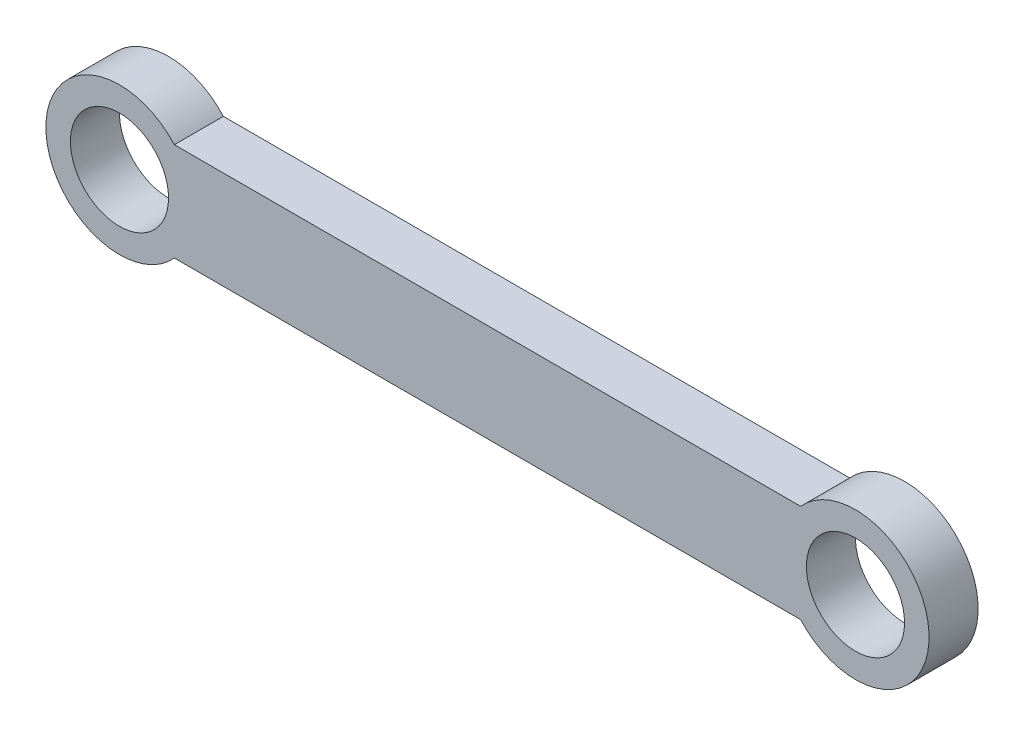
ISO-10303-21;
HEADER;
FILE_DESCRIPTION(('STEP AP214'),'2;1');
FILE_NAME('part.step','',(''),(''),'','','');
FILE_SCHEMA(('AUTOMOTIVE_DESIGN { 1 0 10303 214 1 1 1 1 }'));
ENDSEC;
DATA;
#1=APPLICATION_CONTEXT('core data for automotive mechanical design processes');
#2=APPLICATION_PROTOCOL_DEFINITION('international standard','automotive_design',2000,#1);
#3=PRODUCT_CONTEXT('',#1,'mechanical');
#4=PRODUCT('Part','Part','',(#3));
#5=PRODUCT_RELATED_PRODUCT_CATEGORY('part','',(#4));
#6=PRODUCT_DEFINITION_FORMATION('','',#4);
#7=PRODUCT_DEFINITION_CONTEXT('part definition',#1,'design');
#8=PRODUCT_DEFINITION('design','',#6,#7);
#9=PRODUCT_DEFINITION_SHAPE('','',#8);
#10=(LENGTH_UNIT() NAMED_UNIT(*) SI_UNIT(.MILLI.,.METRE.));
#11=(NAMED_UNIT(*) PLANE_ANGLE_UNIT() SI_UNIT($,.RADIAN.));
#12=(NAMED_UNIT(*) SI_UNIT($,.STERADIAN.) SOLID_ANGLE_UNIT());
#13=UNCERTAINTY_MEASURE_WITH_UNIT(LENGTH_MEASURE(1.E-05),#10,'distance_accuracy_value','');
#14=(GEOMETRIC_REPRESENTATION_CONTEXT(3) GLOBAL_UNCERTAINTY_ASSIGNED_CONTEXT((#13)) GLOBAL_UNIT_ASSIGNED_CONTEXT((#10,
#11,#12)) REPRESENTATION_CONTEXT('',''));
#15=CARTESIAN_POINT('',(0.,0.,0.));
#16=DIRECTION('',(0.,0.,1.));
#17=DIRECTION('',(1.,0.,0.));
#18=AXIS2_PLACEMENT_3D('',#15,#16,#17);
#19=CARTESIAN_POINT('',(15.,0.,2.));
#20=DIRECTION('',(0.,0.,1.));
#21=DIRECTION('',(1.,0.,0.));
#22=AXIS2_PLACEMENT_3D('',#19,#20,#21);
#23=PLANE('',#22);
#24=CARTESIAN_POINT('',(-15.,0.,2.));
#25=DIRECTION('',(0.,0.,1.));
#26=DIRECTION('',(1.,0.,0.));
#27=AXIS2_PLACEMENT_3D('',#24,#25,#26);
#28=CIRCLE('',#27,2.);
#29=CARTESIAN_POINT('',(-13.,0.,2.));
#30=VERTEX_POINT('',#29);
#31=EDGE_CURVE('E103',#30,#30,#28,.T.);
#32=ORIENTED_EDGE('',*,*,#31,.F.);
#33=EDGE_LOOP('',(#32));
#34=FACE_BOUND('',#33,.T.);
#35=CARTESIAN_POINT('',(15.,0.,2.));
#36=DIRECTION('',(0.,0.,1.));
#37=DIRECTION('',(1.,0.,0.));
#38=AXIS2_PLACEMENT_3D('',#35,#36,#37);
#39=CIRCLE('',#38,3.);
#40=CARTESIAN_POINT('',(12.7639320225002,-2.,2.));
#41=VERTEX_POINT('',#40);
#42=CARTESIAN_POINT('',(12.7639320225002,2.,2.));
#43=VERTEX_POINT('',#42);
#44=EDGE_CURVE('E88',#41,#43,#39,.T.);
#45=ORIENTED_EDGE('',*,*,#44,.T.);
#46=DIRECTION('',(-1.,0.,0.));
#47=VECTOR('',#46,1.);
#48=CARTESIAN_POINT('',(-12.7639320225002,2.,2.));
#49=LINE('',#48,#47);
#50=CARTESIAN_POINT('',(-12.7639320225002,2.,2.));
#51=VERTEX_POINT('',#50);
#52=EDGE_CURVE('E83',#43,#51,#49,.T.);
#53=ORIENTED_EDGE('',*,*,#52,.T.);
#54=CARTESIAN_POINT('',(-15.,0.,2.));
#55=DIRECTION('',(0.,0.,1.));
#56=DIRECTION('',(1.,0.,0.));
#57=AXIS2_PLACEMENT_3D('',#54,#55,#56);
#58=CIRCLE('',#57,3.);
#59=CARTESIAN_POINT('',(-12.7639320225002,-2.,2.));
#60=VERTEX_POINT('',#59);
#61=EDGE_CURVE('E86',#51,#60,#58,.T.);
#62=ORIENTED_EDGE('',*,*,#61,.T.);
#63=DIRECTION('',(1.,0.,0.));
#64=VECTOR('',#63,1.);
#65=CARTESIAN_POINT('',(-12.7639320225002,-2.,2.));
#66=LINE('',#65,#64);
#67=EDGE_CURVE('E53',#60,#41,#66,.T.);
#68=ORIENTED_EDGE('',*,*,#67,.T.);
#69=EDGE_LOOP('',(#45,#53,#62,#68));
#70=FACE_BOUND('',#69,.T.);
#71=CARTESIAN_POINT('',(15.,0.,2.));
#72=DIRECTION('',(0.,0.,1.));
#73=DIRECTION('',(1.,0.,0.));
#74=AXIS2_PLACEMENT_3D('',#71,#72,#73);
#75=CIRCLE('',#74,2.);
#76=CARTESIAN_POINT('',(17.,0.,2.));
#77=VERTEX_POINT('',#76);
#78=EDGE_CURVE('E118',#77,#77,#75,.T.);
#79=ORIENTED_EDGE('',*,*,#78,.F.);
#80=EDGE_LOOP('',(#79));
#81=FACE_BOUND('',#80,.T.);
#82=ADVANCED_FACE('F36',(#34,#70,#81),#23,.T.);
#83=CARTESIAN_POINT('',(15.,0.,0.));
#84=DIRECTION('',(0.,0.,1.));
#85=DIRECTION('',(1.,0.,0.));
#86=AXIS2_PLACEMENT_3D('',#83,#84,#85);
#87=PLANE('',#86);
#88=CARTESIAN_POINT('',(15.,0.,0.));
#89=DIRECTION('',(0.,0.,1.));
#90=DIRECTION('',(1.,0.,0.));
#91=AXIS2_PLACEMENT_3D('',#88,#89,#90);
#92=CIRCLE('',#91,3.);
#93=CARTESIAN_POINT('',(12.7639320225002,-2.,0.));
#94=VERTEX_POINT('',#93);
#95=CARTESIAN_POINT('',(12.7639320225002,2.,0.));
#96=VERTEX_POINT('',#95);
#97=EDGE_CURVE('E100',#94,#96,#92,.T.);
#98=ORIENTED_EDGE('',*,*,#97,.F.);
#99=DIRECTION('',(1.,0.,0.));
#100=VECTOR('',#99,1.);
#101=CARTESIAN_POINT('',(-12.7639320225002,-2.,0.));
#102=LINE('',#101,#100);
#103=CARTESIAN_POINT('',(-12.7639320225002,-2.,0.));
#104=VERTEX_POINT('',#103);
#105=EDGE_CURVE('E76',#104,#94,#102,.T.);
#106=ORIENTED_EDGE('',*,*,#105,.F.);
#107=CARTESIAN_POINT('',(-15.,0.,0.));
#108=DIRECTION('',(0.,0.,1.));
#109=DIRECTION('',(1.,0.,0.));
#110=AXIS2_PLACEMENT_3D('',#107,#108,#109);
#111=CIRCLE('',#110,3.);
#112=CARTESIAN_POINT('',(-12.7639320225002,2.,0.));
#113=VERTEX_POINT('',#112);
#114=EDGE_CURVE('E70',#113,#104,#111,.T.);
#115=ORIENTED_EDGE('',*,*,#114,.F.);
#116=DIRECTION('',(-1.,0.,0.));
#117=VECTOR('',#116,1.);
#118=CARTESIAN_POINT('',(-12.7639320225002,2.,0.));
#119=LINE('',#118,#117);
#120=EDGE_CURVE('E92',#96,#113,#119,.T.);
#121=ORIENTED_EDGE('',*,*,#120,.F.);
#122=EDGE_LOOP('',(#98,#106,#115,#121));
#123=FACE_BOUND('',#122,.T.);
#124=CARTESIAN_POINT('',(-15.,0.,0.));
#125=DIRECTION('',(0.,0.,1.));
#126=DIRECTION('',(1.,0.,0.));
#127=AXIS2_PLACEMENT_3D('',#124,#125,#126);
#128=CIRCLE('',#127,2.);
#129=CARTESIAN_POINT('',(-13.,0.,0.));
#130=VERTEX_POINT('',#129);
#131=EDGE_CURVE('E115',#130,#130,#128,.T.);
#132=ORIENTED_EDGE('',*,*,#131,.T.);
#133=EDGE_LOOP('',(#132));
#134=FACE_BOUND('',#133,.T.);
#135=CARTESIAN_POINT('',(15.,0.,0.));
#136=DIRECTION('',(0.,0.,1.));
#137=DIRECTION('',(1.,0.,0.));
#138=AXIS2_PLACEMENT_3D('',#135,#136,#137);
#139=CIRCLE('',#138,2.);
#140=CARTESIAN_POINT('',(17.,0.,0.));
#141=VERTEX_POINT('',#140);
#142=EDGE_CURVE('E121',#141,#141,#139,.T.);
#143=ORIENTED_EDGE('',*,*,#142,.T.);
#144=EDGE_LOOP('',(#143));
#145=FACE_BOUND('',#144,.T.);
#146=ADVANCED_FACE('F111',(#123,#134,#145),#87,.F.);
#147=CARTESIAN_POINT('',(15.,0.,2.));
#148=DIRECTION('',(0.,0.,-1.));
#149=DIRECTION('',(-1.,0.,0.));
#150=AXIS2_PLACEMENT_3D('',#147,#148,#149);
#151=CYLINDRICAL_SURFACE('',#150,3.);
#152=ORIENTED_EDGE('',*,*,#97,.T.);
#153=DIRECTION('',(0.,0.,-1.));
#154=VECTOR('',#153,1.);
#155=CARTESIAN_POINT('',(12.7639320225002,2.,2.));
#156=LINE('',#155,#154);
#157=EDGE_CURVE('E11',#43,#96,#156,.T.);
#158=ORIENTED_EDGE('',*,*,#157,.F.);
#159=ORIENTED_EDGE('',*,*,#44,.F.);
#160=DIRECTION('',(0.,0.,-1.));
#161=VECTOR('',#160,1.);
#162=CARTESIAN_POINT('',(12.7639320225002,-2.,2.));
#163=LINE('',#162,#161);
#164=EDGE_CURVE('E96',#41,#94,#163,.T.);
#165=ORIENTED_EDGE('',*,*,#164,.T.);
#166=EDGE_LOOP('',(#152,#158,#159,#165));
#167=FACE_BOUND('',#166,.T.);
#168=ADVANCED_FACE('F38',(#167),#151,.T.);
#169=CARTESIAN_POINT('',(-12.7639320225002,2.,2.));
#170=DIRECTION('',(0.,-1.,0.));
#171=DIRECTION('',(0.,0.,-1.));
#172=AXIS2_PLACEMENT_3D('',#169,#170,#171);
#173=PLANE('',#172);
#174=ORIENTED_EDGE('',*,*,#120,.T.);
#175=DIRECTION('',(0.,0.,-1.));
#176=VECTOR('',#175,1.);
#177=CARTESIAN_POINT('',(-12.7639320225002,2.,2.));
#178=LINE('',#177,#176);
#179=EDGE_CURVE('E45',#51,#113,#178,.T.);
#180=ORIENTED_EDGE('',*,*,#179,.F.);
#181=ORIENTED_EDGE('',*,*,#52,.F.);
#182=ORIENTED_EDGE('',*,*,#157,.T.);
#183=EDGE_LOOP('',(#174,#180,#181,#182));
#184=FACE_BOUND('',#183,.T.);
#185=ADVANCED_FACE('F91',(#184),#173,.F.);
#186=CARTESIAN_POINT('',(-15.,0.,2.));
#187=DIRECTION('',(0.,0.,-1.));
#188=DIRECTION('',(-1.,0.,0.));
#189=AXIS2_PLACEMENT_3D('',#186,#187,#188);
#190=CYLINDRICAL_SURFACE('',#189,3.);
#191=ORIENTED_EDGE('',*,*,#114,.T.);
#192=DIRECTION('',(0.,0.,-1.));
#193=VECTOR('',#192,1.);
#194=CARTESIAN_POINT('',(-12.7639320225002,-2.,2.));
#195=LINE('',#194,#193);
#196=EDGE_CURVE('E93',#60,#104,#195,.T.);
#197=ORIENTED_EDGE('',*,*,#196,.F.);
#198=ORIENTED_EDGE('',*,*,#61,.F.);
#199=ORIENTED_EDGE('',*,*,#179,.T.);
#200=EDGE_LOOP('',(#191,#197,#198,#199));
#201=FACE_BOUND('',#200,.T.);
#202=ADVANCED_FACE('F94',(#201),#190,.T.);
#203=CARTESIAN_POINT('',(-12.7639320225002,-2.,2.));
#204=DIRECTION('',(0.,1.,0.));
#205=DIRECTION('',(0.,0.,1.));
#206=AXIS2_PLACEMENT_3D('',#203,#204,#205);
#207=PLANE('',#206);
#208=ORIENTED_EDGE('',*,*,#105,.T.);
#209=ORIENTED_EDGE('',*,*,#164,.F.);
#210=ORIENTED_EDGE('',*,*,#67,.F.);
#211=ORIENTED_EDGE('',*,*,#196,.T.);
#212=EDGE_LOOP('',(#208,#209,#210,#211));
#213=FACE_BOUND('',#212,.T.);
#214=ADVANCED_FACE('F108',(#213),#207,.F.);
#215=CARTESIAN_POINT('',(-15.,0.,2.));
#216=DIRECTION('',(0.,0.,-1.));
#217=DIRECTION('',(-1.,0.,0.));
#218=AXIS2_PLACEMENT_3D('',#215,#216,#217);
#219=CYLINDRICAL_SURFACE('',#218,2.);
#220=ORIENTED_EDGE('',*,*,#31,.T.);
#221=EDGE_LOOP('',(#220));
#222=FACE_BOUND('',#221,.T.);
#223=ORIENTED_EDGE('',*,*,#131,.F.);
#224=EDGE_LOOP('',(#223));
#225=FACE_BOUND('',#224,.T.);
#226=ADVANCED_FACE('F138',(#222,#225),#219,.F.);
#227=CARTESIAN_POINT('',(15.,0.,2.));
#228=DIRECTION('',(0.,0.,-1.));
#229=DIRECTION('',(-1.,0.,0.));
#230=AXIS2_PLACEMENT_3D('',#227,#228,#229);
#231=CYLINDRICAL_SURFACE('',#230,2.);
#232=ORIENTED_EDGE('',*,*,#78,.T.);
#233=EDGE_LOOP('',(#232));
#234=FACE_BOUND('',#233,.T.);
#235=ORIENTED_EDGE('',*,*,#142,.F.);
#236=EDGE_LOOP('',(#235));
#237=FACE_BOUND('',#236,.T.);
#238=ADVANCED_FACE('F127',(#234,#237),#231,.F.);
#239=CLOSED_SHELL('',(#82,#146,#168,#185,#202,#214,#226,#238));
#240=MANIFOLD_SOLID_BREP('B2',#239);
#241=ADVANCED_BREP_SHAPE_REPRESENTATION('',(#18,#240),#14);
#242=SHAPE_DEFINITION_REPRESENTATION(#9,#241);
ENDSEC;
END-ISO-10303-21;
